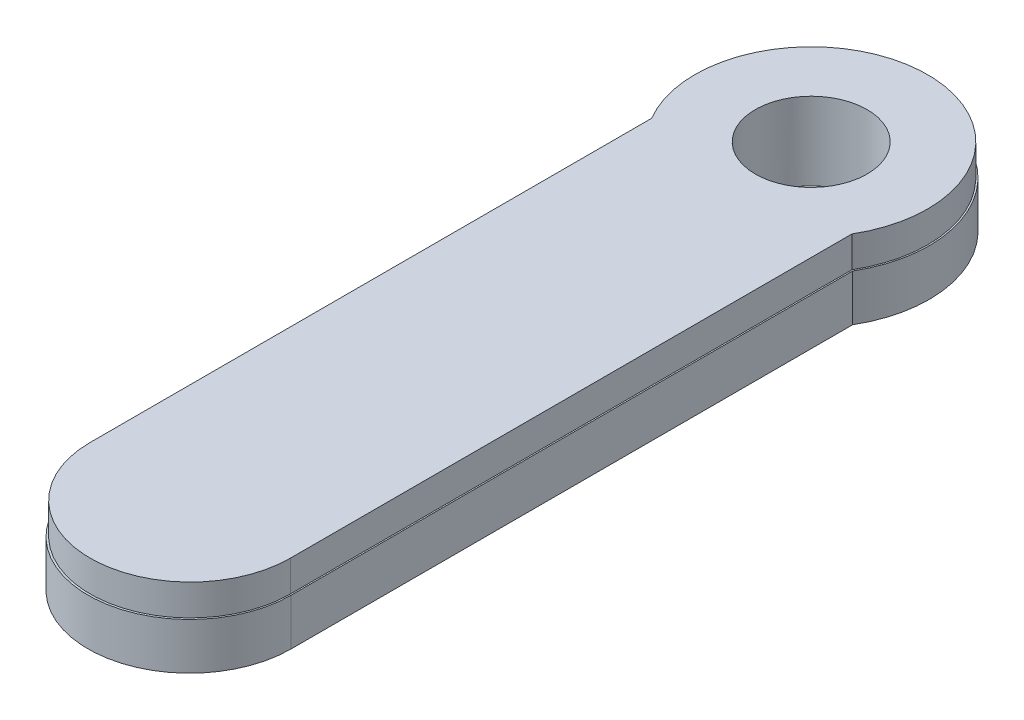
ISO-10303-21;
HEADER;
FILE_DESCRIPTION(('STEP AP214'),'2;1');
FILE_NAME('part.step','',(''),(''),'','','');
FILE_SCHEMA(('AUTOMOTIVE_DESIGN { 1 0 10303 214 1 1 1 1 }'));
ENDSEC;
DATA;
#1=APPLICATION_CONTEXT('core data for automotive mechanical design processes');
#2=APPLICATION_PROTOCOL_DEFINITION('international standard','automotive_design',2000,#1);
#3=PRODUCT_CONTEXT('',#1,'mechanical');
#4=PRODUCT('Part','Part','',(#3));
#5=PRODUCT_RELATED_PRODUCT_CATEGORY('part','',(#4));
#6=PRODUCT_DEFINITION_FORMATION('','',#4);
#7=PRODUCT_DEFINITION_CONTEXT('part definition',#1,'design');
#8=PRODUCT_DEFINITION('design','',#6,#7);
#9=PRODUCT_DEFINITION_SHAPE('','',#8);
#10=(LENGTH_UNIT() NAMED_UNIT(*) SI_UNIT(.MILLI.,.METRE.));
#11=(NAMED_UNIT(*) PLANE_ANGLE_UNIT() SI_UNIT($,.RADIAN.));
#12=(NAMED_UNIT(*) SI_UNIT($,.STERADIAN.) SOLID_ANGLE_UNIT());
#13=UNCERTAINTY_MEASURE_WITH_UNIT(LENGTH_MEASURE(1.E-05),#10,'distance_accuracy_value','');
#14=(GEOMETRIC_REPRESENTATION_CONTEXT(3) GLOBAL_UNCERTAINTY_ASSIGNED_CONTEXT((#13)) GLOBAL_UNIT_ASSIGNED_CONTEXT((#10,
#11,#12)) REPRESENTATION_CONTEXT('',''));
#15=CARTESIAN_POINT('',(0.,0.,0.));
#16=DIRECTION('',(0.,0.,1.));
#17=DIRECTION('',(1.,0.,0.));
#18=AXIS2_PLACEMENT_3D('',#15,#16,#17);
#19=CARTESIAN_POINT('',(0.,3.,0.));
#20=DIRECTION('',(0.,1.,0.));
#21=DIRECTION('',(0.,0.,1.));
#22=AXIS2_PLACEMENT_3D('',#19,#20,#21);
#23=PLANE('',#22);
#24=CARTESIAN_POINT('',(0.,3.,0.));
#25=DIRECTION('',(0.,1.,0.));
#26=DIRECTION('',(0.,0.,1.));
#27=AXIS2_PLACEMENT_3D('',#24,#25,#26);
#28=CIRCLE('',#27,7.50000000000003);
#29=CARTESIAN_POINT('',(6.45199608338664,3.,3.82383924086302));
#30=VERTEX_POINT('',#29);
#31=CARTESIAN_POINT('',(-6.45199608338667,3.,3.82383924086297));
#32=VERTEX_POINT('',#31);
#33=EDGE_CURVE('E55',#30,#32,#28,.T.);
#34=ORIENTED_EDGE('',*,*,#33,.F.);
#35=DIRECTION('',(0.,0.,-1.));
#36=VECTOR('',#35,1.);
#37=CARTESIAN_POINT('',(6.45199608338664,3.,40.));
#38=LINE('',#37,#36);
#39=CARTESIAN_POINT('',(6.45199608338665,3.,40.));
#40=VERTEX_POINT('',#39);
#41=EDGE_CURVE('E59',#40,#30,#38,.T.);
#42=ORIENTED_EDGE('',*,*,#41,.F.);
#43=CARTESIAN_POINT('',(0.,3.,40.));
#44=DIRECTION('',(0.,1.,0.));
#45=DIRECTION('',(0.,0.,1.));
#46=AXIS2_PLACEMENT_3D('',#43,#44,#45);
#47=CIRCLE('',#46,6.45199608338665);
#48=CARTESIAN_POINT('',(-6.45199608338667,3.,40.));
#49=VERTEX_POINT('',#48);
#50=EDGE_CURVE('E305',#49,#40,#47,.T.);
#51=ORIENTED_EDGE('',*,*,#50,.F.);
#52=DIRECTION('',(0.,0.,1.));
#53=VECTOR('',#52,1.);
#54=CARTESIAN_POINT('',(-6.45199608338667,3.,3.82383924086297));
#55=LINE('',#54,#53);
#56=EDGE_CURVE('E294',#32,#49,#55,.T.);
#57=ORIENTED_EDGE('',*,*,#56,.F.);
#58=EDGE_LOOP('',(#34,#42,#51,#57));
#59=FACE_BOUND('',#58,.T.);
#60=CARTESIAN_POINT('',(0.,3.,0.));
#61=DIRECTION('',(0.,1.,0.));
#62=DIRECTION('',(0.,0.,1.));
#63=AXIS2_PLACEMENT_3D('',#60,#61,#62);
#64=CIRCLE('',#63,7.6);
#65=CARTESIAN_POINT('',(6.54186916997502,3.,3.86832622240296));
#66=VERTEX_POINT('',#65);
#67=CARTESIAN_POINT('',(-6.54186916997502,3.,3.86832622240296));
#68=VERTEX_POINT('',#67);
#69=EDGE_CURVE('E202',#66,#68,#64,.T.);
#70=ORIENTED_EDGE('',*,*,#69,.T.);
#71=DIRECTION('',(0.,0.,1.));
#72=VECTOR('',#71,1.);
#73=CARTESIAN_POINT('',(-6.54186916997502,3.,3.86832622240296));
#74=LINE('',#73,#72);
#75=CARTESIAN_POINT('',(-6.54186916997502,3.,40.04448698154));
#76=VERTEX_POINT('',#75);
#77=EDGE_CURVE('E206',#68,#76,#74,.T.);
#78=ORIENTED_EDGE('',*,*,#77,.T.);
#79=CARTESIAN_POINT('',(0.,3.,40.04448698154));
#80=DIRECTION('',(0.,1.,0.));
#81=DIRECTION('',(0.,0.,1.));
#82=AXIS2_PLACEMENT_3D('',#79,#80,#81);
#83=CIRCLE('',#82,6.54186916997502);
#84=CARTESIAN_POINT('',(6.54186916997502,3.,40.04448698154));
#85=VERTEX_POINT('',#84);
#86=EDGE_CURVE('E210',#76,#85,#83,.T.);
#87=ORIENTED_EDGE('',*,*,#86,.T.);
#88=DIRECTION('',(0.,0.,-1.));
#89=VECTOR('',#88,1.);
#90=CARTESIAN_POINT('',(6.54186916997502,3.,40.04448698154));
#91=LINE('',#90,#89);
#92=EDGE_CURVE('E213',#85,#66,#91,.T.);
#93=ORIENTED_EDGE('',*,*,#92,.T.);
#94=EDGE_LOOP('',(#70,#78,#87,#93));
#95=FACE_BOUND('',#94,.T.);
#96=ADVANCED_FACE('F39',(#59,#95),#23,.T.);
#97=CARTESIAN_POINT('',(0.,0.,0.));
#98=DIRECTION('',(0.,1.,0.));
#99=DIRECTION('',(0.,0.,1.));
#100=AXIS2_PLACEMENT_3D('',#97,#98,#99);
#101=PLANE('',#100);
#102=CARTESIAN_POINT('',(0.,0.,0.));
#103=DIRECTION('',(0.,1.,0.));
#104=DIRECTION('',(0.,0.,1.));
#105=AXIS2_PLACEMENT_3D('',#102,#103,#104);
#106=CIRCLE('',#105,7.6);
#107=CARTESIAN_POINT('',(6.54186916997502,0.,3.86832622240296));
#108=VERTEX_POINT('',#107);
#109=CARTESIAN_POINT('',(-6.54186916997502,0.,3.86832622240296));
#110=VERTEX_POINT('',#109);
#111=EDGE_CURVE('E201',#108,#110,#106,.T.);
#112=ORIENTED_EDGE('',*,*,#111,.F.);
#113=DIRECTION('',(0.,0.,-1.));
#114=VECTOR('',#113,1.);
#115=CARTESIAN_POINT('',(6.54186916997502,0.,40.04448698154));
#116=LINE('',#115,#114);
#117=CARTESIAN_POINT('',(6.54186916997502,0.,40.04448698154));
#118=VERTEX_POINT('',#117);
#119=EDGE_CURVE('E207',#118,#108,#116,.T.);
#120=ORIENTED_EDGE('',*,*,#119,.F.);
#121=CARTESIAN_POINT('',(0.,0.,40.04448698154));
#122=DIRECTION('',(0.,1.,0.));
#123=DIRECTION('',(0.,0.,1.));
#124=AXIS2_PLACEMENT_3D('',#121,#122,#123);
#125=CIRCLE('',#124,6.54186916997502);
#126=CARTESIAN_POINT('',(-6.54186916997502,0.,40.04448698154));
#127=VERTEX_POINT('',#126);
#128=EDGE_CURVE('E223',#127,#118,#125,.T.);
#129=ORIENTED_EDGE('',*,*,#128,.F.);
#130=DIRECTION('',(0.,0.,1.));
#131=VECTOR('',#130,1.);
#132=CARTESIAN_POINT('',(-6.54186916997502,0.,3.86832622240296));
#133=LINE('',#132,#131);
#134=EDGE_CURVE('E220',#110,#127,#133,.T.);
#135=ORIENTED_EDGE('',*,*,#134,.F.);
#136=EDGE_LOOP('',(#112,#120,#129,#135));
#137=FACE_BOUND('',#136,.T.);
#138=CARTESIAN_POINT('',(0.,0.,0.));
#139=DIRECTION('',(0.,1.,0.));
#140=DIRECTION('',(0.,0.,1.));
#141=AXIS2_PLACEMENT_3D('',#138,#139,#140);
#142=CIRCLE('',#141,3.6);
#143=CARTESIAN_POINT('',(2.6,0.,2.48997991959775));
#144=VERTEX_POINT('',#143);
#145=CARTESIAN_POINT('',(-2.6,0.,2.48997991959775));
#146=VERTEX_POINT('',#145);
#147=EDGE_CURVE('E153',#144,#146,#142,.T.);
#148=ORIENTED_EDGE('',*,*,#147,.T.);
#149=DIRECTION('',(0.0450819672131148,0.,0.998983291267775));
#150=VECTOR('',#149,1.);
#151=CARTESIAN_POINT('',(-2.6,0.,2.48997991959775));
#152=LINE('',#151,#150);
#153=CARTESIAN_POINT('',(-2.05,0.,14.6775760730646));
#154=VERTEX_POINT('',#153);
#155=EDGE_CURVE('E158',#146,#154,#152,.T.);
#156=ORIENTED_EDGE('',*,*,#155,.T.);
#157=CARTESIAN_POINT('',(0.,0.,14.5850639824273));
#158=DIRECTION('',(0.,1.,0.));
#159=DIRECTION('',(0.,0.,1.));
#160=AXIS2_PLACEMENT_3D('',#157,#158,#159);
#161=CIRCLE('',#160,2.05208637413586);
#162=CARTESIAN_POINT('',(2.05,0.,14.6775760730646));
#163=VERTEX_POINT('',#162);
#164=EDGE_CURVE('E181',#154,#163,#161,.T.);
#165=ORIENTED_EDGE('',*,*,#164,.T.);
#166=DIRECTION('',(0.0450819672131147,0.,-0.998983291267775));
#167=VECTOR('',#166,1.);
#168=CARTESIAN_POINT('',(2.6,0.,2.48997991959775));
#169=LINE('',#168,#167);
#170=EDGE_CURVE('E169',#163,#144,#169,.T.);
#171=ORIENTED_EDGE('',*,*,#170,.T.);
#172=EDGE_LOOP('',(#148,#156,#165,#171));
#173=FACE_BOUND('',#172,.T.);
#174=ADVANCED_FACE('F246',(#137,#173),#101,.F.);
#175=CARTESIAN_POINT('',(0.,3.,0.));
#176=DIRECTION('',(0.,-1.,0.));
#177=DIRECTION('',(0.,0.,-1.));
#178=AXIS2_PLACEMENT_3D('',#175,#176,#177);
#179=CYLINDRICAL_SURFACE('',#178,7.6);
#180=ORIENTED_EDGE('',*,*,#111,.T.);
#181=DIRECTION('',(0.,-1.,0.));
#182=VECTOR('',#181,1.);
#183=CARTESIAN_POINT('',(-6.54186916997502,3.,3.86832622240296));
#184=LINE('',#183,#182);
#185=EDGE_CURVE('E11',#68,#110,#184,.T.);
#186=ORIENTED_EDGE('',*,*,#185,.F.);
#187=ORIENTED_EDGE('',*,*,#69,.F.);
#188=DIRECTION('',(0.,-1.,0.));
#189=VECTOR('',#188,1.);
#190=CARTESIAN_POINT('',(6.54186916997502,3.,3.86832622240296));
#191=LINE('',#190,#189);
#192=EDGE_CURVE('E216',#66,#108,#191,.T.);
#193=ORIENTED_EDGE('',*,*,#192,.T.);
#194=EDGE_LOOP('',(#180,#186,#187,#193));
#195=FACE_BOUND('',#194,.T.);
#196=ADVANCED_FACE('F41',(#195),#179,.T.);
#197=CARTESIAN_POINT('',(-6.54186916997502,3.,3.86832622240296));
#198=DIRECTION('',(1.,0.,0.));
#199=DIRECTION('',(0.,0.,-1.));
#200=AXIS2_PLACEMENT_3D('',#197,#198,#199);
#201=PLANE('',#200);
#202=ORIENTED_EDGE('',*,*,#134,.T.);
#203=DIRECTION('',(0.,-1.,0.));
#204=VECTOR('',#203,1.);
#205=CARTESIAN_POINT('',(-6.54186916997502,3.,40.04448698154));
#206=LINE('',#205,#204);
#207=EDGE_CURVE('E48',#76,#127,#206,.T.);
#208=ORIENTED_EDGE('',*,*,#207,.F.);
#209=ORIENTED_EDGE('',*,*,#77,.F.);
#210=ORIENTED_EDGE('',*,*,#185,.T.);
#211=EDGE_LOOP('',(#202,#208,#209,#210));
#212=FACE_BOUND('',#211,.T.);
#213=ADVANCED_FACE('F256',(#212),#201,.F.);
#214=CARTESIAN_POINT('',(0.,3.,40.04448698154));
#215=DIRECTION('',(0.,-1.,0.));
#216=DIRECTION('',(0.,0.,-1.));
#217=AXIS2_PLACEMENT_3D('',#214,#215,#216);
#218=CYLINDRICAL_SURFACE('',#217,6.54186916997502);
#219=ORIENTED_EDGE('',*,*,#128,.T.);
#220=DIRECTION('',(0.,-1.,0.));
#221=VECTOR('',#220,1.);
#222=CARTESIAN_POINT('',(6.54186916997502,3.,40.04448698154));
#223=LINE('',#222,#221);
#224=EDGE_CURVE('E231',#85,#118,#223,.T.);
#225=ORIENTED_EDGE('',*,*,#224,.F.);
#226=ORIENTED_EDGE('',*,*,#86,.F.);
#227=ORIENTED_EDGE('',*,*,#207,.T.);
#228=EDGE_LOOP('',(#219,#225,#226,#227));
#229=FACE_BOUND('',#228,.T.);
#230=ADVANCED_FACE('F240',(#229),#218,.T.);
#231=CARTESIAN_POINT('',(6.54186916997502,3.,40.04448698154));
#232=DIRECTION('',(-1.,0.,0.));
#233=DIRECTION('',(0.,0.,1.));
#234=AXIS2_PLACEMENT_3D('',#231,#232,#233);
#235=PLANE('',#234);
#236=ORIENTED_EDGE('',*,*,#119,.T.);
#237=ORIENTED_EDGE('',*,*,#192,.F.);
#238=ORIENTED_EDGE('',*,*,#92,.F.);
#239=ORIENTED_EDGE('',*,*,#224,.T.);
#240=EDGE_LOOP('',(#236,#237,#238,#239));
#241=FACE_BOUND('',#240,.T.);
#242=ADVANCED_FACE('F250',(#241),#235,.F.);
#243=CARTESIAN_POINT('',(0.,3.,0.));
#244=DIRECTION('',(0.,-1.,0.));
#245=DIRECTION('',(0.,0.,-1.));
#246=AXIS2_PLACEMENT_3D('',#243,#244,#245);
#247=CYLINDRICAL_SURFACE('',#246,3.6);
#248=ORIENTED_EDGE('',*,*,#147,.F.);
#249=DIRECTION('',(0.,-1.,0.));
#250=VECTOR('',#249,1.);
#251=CARTESIAN_POINT('',(2.6,3.,2.48997991959775));
#252=LINE('',#251,#250);
#253=CARTESIAN_POINT('',(2.6,3.,2.48997991959775));
#254=VERTEX_POINT('',#253);
#255=EDGE_CURVE('E176',#254,#144,#252,.T.);
#256=ORIENTED_EDGE('',*,*,#255,.F.);
#257=CARTESIAN_POINT('',(0.,3.,0.));
#258=DIRECTION('',(0.,1.,0.));
#259=DIRECTION('',(0.,0.,1.));
#260=AXIS2_PLACEMENT_3D('',#257,#258,#259);
#261=CIRCLE('',#260,3.6);
#262=CARTESIAN_POINT('',(-2.6,3.,2.48997991959775));
#263=VERTEX_POINT('',#262);
#264=EDGE_CURVE('E290',#263,#254,#261,.T.);
#265=ORIENTED_EDGE('',*,*,#264,.F.);
#266=DIRECTION('',(0.,-1.,0.));
#267=VECTOR('',#266,1.);
#268=CARTESIAN_POINT('',(-2.6,3.,2.48997991959775));
#269=LINE('',#268,#267);
#270=EDGE_CURVE('E197',#263,#146,#269,.T.);
#271=ORIENTED_EDGE('',*,*,#270,.T.);
#272=EDGE_LOOP('',(#248,#256,#265,#271));
#273=FACE_BOUND('',#272,.T.);
#274=CARTESIAN_POINT('',(0.,5.,0.));
#275=DIRECTION('',(0.,1.,0.));
#276=DIRECTION('',(0.,0.,1.));
#277=AXIS2_PLACEMENT_3D('',#274,#275,#276);
#278=CIRCLE('',#277,3.6);
#279=CARTESIAN_POINT('',(0.,5.,3.6));
#280=VERTEX_POINT('',#279);
#281=EDGE_CURVE('E288',#280,#280,#278,.T.);
#282=ORIENTED_EDGE('',*,*,#281,.T.);
#283=EDGE_LOOP('',(#282));
#284=FACE_BOUND('',#283,.T.);
#285=ADVANCED_FACE('F270',(#273,#284),#247,.F.);
#286=CARTESIAN_POINT('',(-2.6,3.,2.48997991959775));
#287=DIRECTION('',(0.998983291267775,0.,-0.0450819672131148));
#288=DIRECTION('',(-0.0450819672131148,0.,-0.998983291267775));
#289=AXIS2_PLACEMENT_3D('',#286,#287,#288);
#290=PLANE('',#289);
#291=ORIENTED_EDGE('',*,*,#155,.F.);
#292=ORIENTED_EDGE('',*,*,#270,.F.);
#293=DIRECTION('',(0.0450819672131148,0.,0.998983291267775));
#294=VECTOR('',#293,1.);
#295=CARTESIAN_POINT('',(-2.6,3.,2.48997991959775));
#296=LINE('',#295,#294);
#297=CARTESIAN_POINT('',(-2.05,3.,14.6775760730646));
#298=VERTEX_POINT('',#297);
#299=EDGE_CURVE('E164',#263,#298,#296,.T.);
#300=ORIENTED_EDGE('',*,*,#299,.T.);
#301=DIRECTION('',(0.,-1.,0.));
#302=VECTOR('',#301,1.);
#303=CARTESIAN_POINT('',(-2.05,3.,14.6775760730646));
#304=LINE('',#303,#302);
#305=EDGE_CURVE('E194',#298,#154,#304,.T.);
#306=ORIENTED_EDGE('',*,*,#305,.T.);
#307=EDGE_LOOP('',(#291,#292,#300,#306));
#308=FACE_BOUND('',#307,.T.);
#309=ADVANCED_FACE('F277',(#308),#290,.T.);
#310=CARTESIAN_POINT('',(0.,3.,14.5850639824273));
#311=DIRECTION('',(0.,-1.,0.));
#312=DIRECTION('',(0.,0.,-1.));
#313=AXIS2_PLACEMENT_3D('',#310,#311,#312);
#314=CYLINDRICAL_SURFACE('',#313,2.05208637413586);
#315=ORIENTED_EDGE('',*,*,#164,.F.);
#316=ORIENTED_EDGE('',*,*,#305,.F.);
#317=CARTESIAN_POINT('',(0.,3.,14.5850639824273));
#318=DIRECTION('',(0.,1.,0.));
#319=DIRECTION('',(0.,0.,1.));
#320=AXIS2_PLACEMENT_3D('',#317,#318,#319);
#321=CIRCLE('',#320,2.05208637413586);
#322=CARTESIAN_POINT('',(2.05,3.,14.6775760730646));
#323=VERTEX_POINT('',#322);
#324=EDGE_CURVE('E168',#298,#323,#321,.T.);
#325=ORIENTED_EDGE('',*,*,#324,.T.);
#326=DIRECTION('',(0.,-1.,0.));
#327=VECTOR('',#326,1.);
#328=CARTESIAN_POINT('',(2.05,3.,14.6775760730646));
#329=LINE('',#328,#327);
#330=EDGE_CURVE('E191',#323,#163,#329,.T.);
#331=ORIENTED_EDGE('',*,*,#330,.T.);
#332=EDGE_LOOP('',(#315,#316,#325,#331));
#333=FACE_BOUND('',#332,.T.);
#334=ADVANCED_FACE('F282',(#333),#314,.F.);
#335=CARTESIAN_POINT('',(2.6,3.,2.48997991959775));
#336=DIRECTION('',(-0.998983291267775,0.,-0.0450819672131147));
#337=DIRECTION('',(-0.0450819672131147,0.,0.998983291267775));
#338=AXIS2_PLACEMENT_3D('',#335,#336,#337);
#339=PLANE('',#338);
#340=ORIENTED_EDGE('',*,*,#170,.F.);
#341=ORIENTED_EDGE('',*,*,#330,.F.);
#342=DIRECTION('',(0.0450819672131147,0.,-0.998983291267775));
#343=VECTOR('',#342,1.);
#344=CARTESIAN_POINT('',(2.6,3.,2.48997991959775));
#345=LINE('',#344,#343);
#346=EDGE_CURVE('E173',#323,#254,#345,.T.);
#347=ORIENTED_EDGE('',*,*,#346,.T.);
#348=ORIENTED_EDGE('',*,*,#255,.T.);
#349=EDGE_LOOP('',(#340,#341,#347,#348));
#350=FACE_BOUND('',#349,.T.);
#351=ADVANCED_FACE('F331',(#350),#339,.T.);
#352=CARTESIAN_POINT('',(0.,5.,0.));
#353=DIRECTION('',(0.,1.,0.));
#354=DIRECTION('',(0.,0.,1.));
#355=AXIS2_PLACEMENT_3D('',#352,#353,#354);
#356=PLANE('',#355);
#357=CARTESIAN_POINT('',(0.,5.,0.));
#358=DIRECTION('',(0.,1.,0.));
#359=DIRECTION('',(0.,0.,1.));
#360=AXIS2_PLACEMENT_3D('',#357,#358,#359);
#361=CIRCLE('',#360,7.50000000000003);
#362=CARTESIAN_POINT('',(6.45199608338664,5.,3.82383924086302));
#363=VERTEX_POINT('',#362);
#364=CARTESIAN_POINT('',(-6.45199608338667,5.,3.82383924086297));
#365=VERTEX_POINT('',#364);
#366=EDGE_CURVE('E139',#363,#365,#361,.T.);
#367=ORIENTED_EDGE('',*,*,#366,.T.);
#368=DIRECTION('',(0.,0.,1.));
#369=VECTOR('',#368,1.);
#370=CARTESIAN_POINT('',(-6.45199608338667,5.,3.82383924086297));
#371=LINE('',#370,#369);
#372=CARTESIAN_POINT('',(-6.45199608338667,5.,40.));
#373=VERTEX_POINT('',#372);
#374=EDGE_CURVE('E127',#365,#373,#371,.T.);
#375=ORIENTED_EDGE('',*,*,#374,.T.);
#376=CARTESIAN_POINT('',(0.,5.,40.));
#377=DIRECTION('',(0.,1.,0.));
#378=DIRECTION('',(0.,0.,1.));
#379=AXIS2_PLACEMENT_3D('',#376,#377,#378);
#380=CIRCLE('',#379,6.45199608338665);
#381=CARTESIAN_POINT('',(6.45199608338665,5.,40.));
#382=VERTEX_POINT('',#381);
#383=EDGE_CURVE('E138',#373,#382,#380,.T.);
#384=ORIENTED_EDGE('',*,*,#383,.T.);
#385=DIRECTION('',(0.,0.,-1.));
#386=VECTOR('',#385,1.);
#387=CARTESIAN_POINT('',(6.45199608338664,5.,40.));
#388=LINE('',#387,#386);
#389=EDGE_CURVE('E145',#382,#363,#388,.T.);
#390=ORIENTED_EDGE('',*,*,#389,.T.);
#391=EDGE_LOOP('',(#367,#375,#384,#390));
#392=FACE_BOUND('',#391,.T.);
#393=ORIENTED_EDGE('',*,*,#281,.F.);
#394=EDGE_LOOP('',(#393));
#395=FACE_BOUND('',#394,.T.);
#396=ADVANCED_FACE('F142',(#392,#395),#356,.T.);
#397=CARTESIAN_POINT('',(0.,3.,0.));
#398=DIRECTION('',(0.,1.,0.));
#399=DIRECTION('',(0.,0.,1.));
#400=AXIS2_PLACEMENT_3D('',#397,#398,#399);
#401=PLANE('',#400);
#402=ORIENTED_EDGE('',*,*,#299,.F.);
#403=ORIENTED_EDGE('',*,*,#264,.T.);
#404=ORIENTED_EDGE('',*,*,#346,.F.);
#405=ORIENTED_EDGE('',*,*,#324,.F.);
#406=EDGE_LOOP('',(#402,#403,#404,#405));
#407=FACE_BOUND('',#406,.T.);
#408=ADVANCED_FACE('F330',(#407),#401,.F.);
#409=CARTESIAN_POINT('',(0.,5.,0.));
#410=DIRECTION('',(0.,-1.,0.));
#411=DIRECTION('',(0.,0.,-1.));
#412=AXIS2_PLACEMENT_3D('',#409,#410,#411);
#413=CYLINDRICAL_SURFACE('',#412,7.50000000000003);
#414=ORIENTED_EDGE('',*,*,#33,.T.);
#415=DIRECTION('',(0.,-1.,0.));
#416=VECTOR('',#415,1.);
#417=CARTESIAN_POINT('',(-6.45199608338667,5.,3.82383924086297));
#418=LINE('',#417,#416);
#419=EDGE_CURVE('E132',#365,#32,#418,.T.);
#420=ORIENTED_EDGE('',*,*,#419,.F.);
#421=ORIENTED_EDGE('',*,*,#366,.F.);
#422=DIRECTION('',(0.,-1.,0.));
#423=VECTOR('',#422,1.);
#424=CARTESIAN_POINT('',(6.45199608338664,5.,3.82383924086302));
#425=LINE('',#424,#423);
#426=EDGE_CURVE('E301',#363,#30,#425,.T.);
#427=ORIENTED_EDGE('',*,*,#426,.T.);
#428=EDGE_LOOP('',(#414,#420,#421,#427));
#429=FACE_BOUND('',#428,.T.);
#430=ADVANCED_FACE('F151',(#429),#413,.T.);
#431=CARTESIAN_POINT('',(-6.45199608338667,5.,3.82383924086297));
#432=DIRECTION('',(1.,0.,0.));
#433=DIRECTION('',(0.,0.,-1.));
#434=AXIS2_PLACEMENT_3D('',#431,#432,#433);
#435=PLANE('',#434);
#436=ORIENTED_EDGE('',*,*,#56,.T.);
#437=DIRECTION('',(0.,-1.,0.));
#438=VECTOR('',#437,1.);
#439=CARTESIAN_POINT('',(-6.45199608338667,5.,40.));
#440=LINE('',#439,#438);
#441=EDGE_CURVE('E134',#373,#49,#440,.T.);
#442=ORIENTED_EDGE('',*,*,#441,.F.);
#443=ORIENTED_EDGE('',*,*,#374,.F.);
#444=ORIENTED_EDGE('',*,*,#419,.T.);
#445=EDGE_LOOP('',(#436,#442,#443,#444));
#446=FACE_BOUND('',#445,.T.);
#447=ADVANCED_FACE('F130',(#446),#435,.F.);
#448=CARTESIAN_POINT('',(0.,5.,40.));
#449=DIRECTION('',(0.,-1.,0.));
#450=DIRECTION('',(0.,0.,-1.));
#451=AXIS2_PLACEMENT_3D('',#448,#449,#450);
#452=CYLINDRICAL_SURFACE('',#451,6.45199608338665);
#453=ORIENTED_EDGE('',*,*,#50,.T.);
#454=DIRECTION('',(0.,-1.,0.));
#455=VECTOR('',#454,1.);
#456=CARTESIAN_POINT('',(6.45199608338665,5.,40.));
#457=LINE('',#456,#455);
#458=EDGE_CURVE('E160',#382,#40,#457,.T.);
#459=ORIENTED_EDGE('',*,*,#458,.F.);
#460=ORIENTED_EDGE('',*,*,#383,.F.);
#461=ORIENTED_EDGE('',*,*,#441,.T.);
#462=EDGE_LOOP('',(#453,#459,#460,#461));
#463=FACE_BOUND('',#462,.T.);
#464=ADVANCED_FACE('F317',(#463),#452,.T.);
#465=CARTESIAN_POINT('',(6.45199608338664,5.,40.));
#466=DIRECTION('',(-1.,0.,0.));
#467=DIRECTION('',(0.,0.,1.));
#468=AXIS2_PLACEMENT_3D('',#465,#466,#467);
#469=PLANE('',#468);
#470=ORIENTED_EDGE('',*,*,#41,.T.);
#471=ORIENTED_EDGE('',*,*,#426,.F.);
#472=ORIENTED_EDGE('',*,*,#389,.F.);
#473=ORIENTED_EDGE('',*,*,#458,.T.);
#474=EDGE_LOOP('',(#470,#471,#472,#473));
#475=FACE_BOUND('',#474,.T.);
#476=ADVANCED_FACE('F315',(#475),#469,.F.);
#477=CLOSED_SHELL('',(#96,#174,#196,#213,#230,#242,#285,#309,#334,#351,#396,#408,#430,#447,#464,#476));
#478=MANIFOLD_SOLID_BREP('B2',#477);
#479=ADVANCED_BREP_SHAPE_REPRESENTATION('',(#18,#478),#14);
#480=SHAPE_DEFINITION_REPRESENTATION(#9,#479);
ENDSEC;
END-ISO-10303-21;
